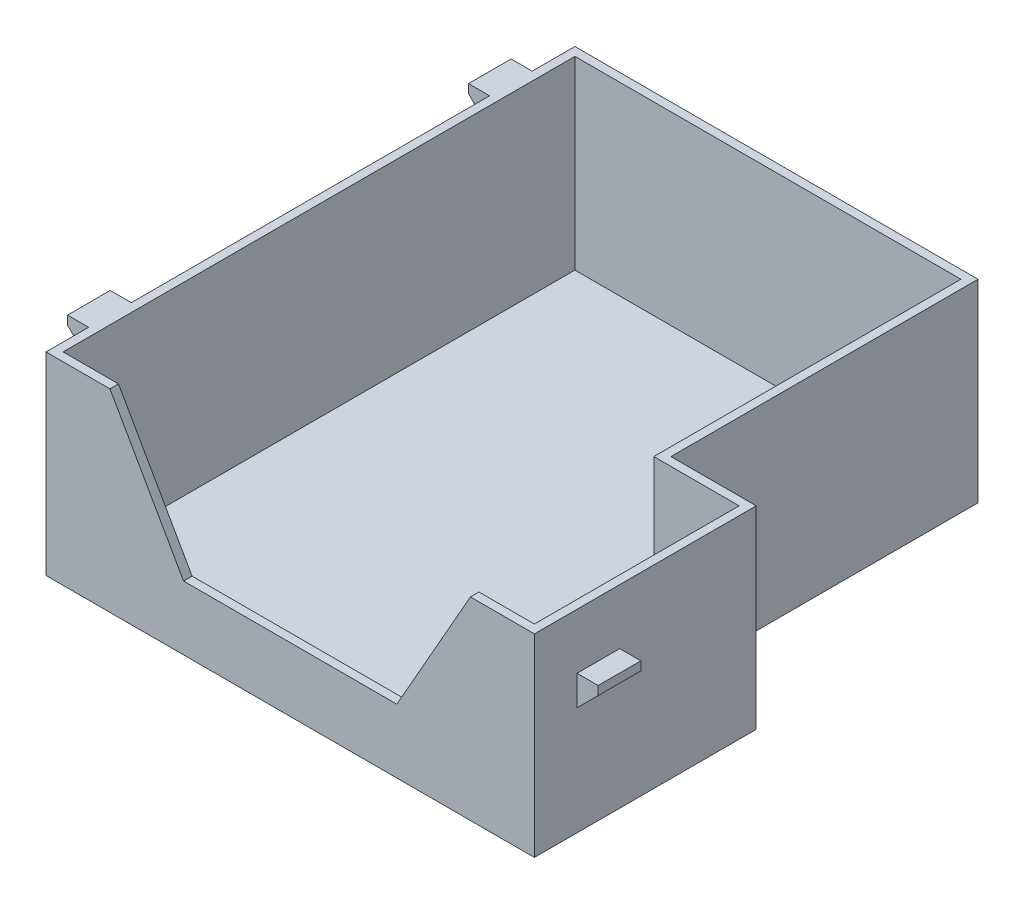
ISO-10303-21;
HEADER;
FILE_DESCRIPTION(('STEP AP214'),'2;1');
FILE_NAME('part.step','',(''),(''),'','','');
FILE_SCHEMA(('AUTOMOTIVE_DESIGN { 1 0 10303 214 1 1 1 1 }'));
ENDSEC;
DATA;
#1=APPLICATION_CONTEXT('core data for automotive mechanical design processes');
#2=APPLICATION_PROTOCOL_DEFINITION('international standard','automotive_design',2000,#1);
#3=PRODUCT_CONTEXT('',#1,'mechanical');
#4=PRODUCT('Part','Part','',(#3));
#5=PRODUCT_RELATED_PRODUCT_CATEGORY('part','',(#4));
#6=PRODUCT_DEFINITION_FORMATION('','',#4);
#7=PRODUCT_DEFINITION_CONTEXT('part definition',#1,'design');
#8=PRODUCT_DEFINITION('design','',#6,#7);
#9=PRODUCT_DEFINITION_SHAPE('','',#8);
#10=(LENGTH_UNIT() NAMED_UNIT(*) SI_UNIT(.MILLI.,.METRE.));
#11=(NAMED_UNIT(*) PLANE_ANGLE_UNIT() SI_UNIT($,.RADIAN.));
#12=(NAMED_UNIT(*) SI_UNIT($,.STERADIAN.) SOLID_ANGLE_UNIT());
#13=UNCERTAINTY_MEASURE_WITH_UNIT(LENGTH_MEASURE(1.E-05),#10,'distance_accuracy_value','');
#14=(GEOMETRIC_REPRESENTATION_CONTEXT(3) GLOBAL_UNCERTAINTY_ASSIGNED_CONTEXT((#13)) GLOBAL_UNIT_ASSIGNED_CONTEXT((#10,
#11,#12)) REPRESENTATION_CONTEXT('',''));
#15=CARTESIAN_POINT('',(0.,0.,0.));
#16=DIRECTION('',(0.,0.,1.));
#17=DIRECTION('',(1.,0.,0.));
#18=AXIS2_PLACEMENT_3D('',#15,#16,#17);
#19=CARTESIAN_POINT('',(0.,2.,0.));
#20=DIRECTION('',(0.,-1.,0.));
#21=DIRECTION('',(0.,0.,-1.));
#22=AXIS2_PLACEMENT_3D('',#19,#20,#21);
#23=PLANE('',#22);
#24=DIRECTION('',(0.,0.,1.));
#25=VECTOR('',#24,1.);
#26=CARTESIAN_POINT('',(35.25,2.,0.));
#27=LINE('',#26,#25);
#28=CARTESIAN_POINT('',(35.25,2.,-60.));
#29=VERTEX_POINT('',#28);
#30=CARTESIAN_POINT('',(35.25,2.,12.));
#31=VERTEX_POINT('',#30);
#32=EDGE_CURVE('E313',#29,#31,#27,.T.);
#33=ORIENTED_EDGE('',*,*,#32,.F.);
#34=DIRECTION('',(-1.,0.,0.));
#35=VECTOR('',#34,1.);
#36=CARTESIAN_POINT('',(0.,2.,-60.));
#37=LINE('',#36,#35);
#38=CARTESIAN_POINT('',(-55.25,2.,-60.));
#39=VERTEX_POINT('',#38);
#40=EDGE_CURVE('E245',#29,#39,#37,.T.);
#41=ORIENTED_EDGE('',*,*,#40,.T.);
#42=DIRECTION('',(0.,0.,1.));
#43=VECTOR('',#42,1.);
#44=CARTESIAN_POINT('',(-55.25,2.,0.));
#45=LINE('',#44,#43);
#46=CARTESIAN_POINT('',(-55.25,2.,60.));
#47=VERTEX_POINT('',#46);
#48=EDGE_CURVE('E419',#39,#47,#45,.T.);
#49=ORIENTED_EDGE('',*,*,#48,.T.);
#50=DIRECTION('',(1.,0.,0.));
#51=VECTOR('',#50,1.);
#52=CARTESIAN_POINT('',(0.,2.,60.));
#53=LINE('',#52,#51);
#54=CARTESIAN_POINT('',(55.25,2.,60.));
#55=VERTEX_POINT('',#54);
#56=EDGE_CURVE('E257',#47,#55,#53,.T.);
#57=ORIENTED_EDGE('',*,*,#56,.T.);
#58=DIRECTION('',(0.,0.,-1.));
#59=VECTOR('',#58,1.);
#60=CARTESIAN_POINT('',(55.25,2.,0.));
#61=LINE('',#60,#59);
#62=CARTESIAN_POINT('',(55.25,2.,12.));
#63=VERTEX_POINT('',#62);
#64=EDGE_CURVE('E414',#55,#63,#61,.T.);
#65=ORIENTED_EDGE('',*,*,#64,.T.);
#66=DIRECTION('',(-1.,0.,0.));
#67=VECTOR('',#66,1.);
#68=CARTESIAN_POINT('',(57.25,2.,12.));
#69=LINE('',#68,#67);
#70=EDGE_CURVE('E62',#63,#31,#69,.T.);
#71=ORIENTED_EDGE('',*,*,#70,.T.);
#72=EDGE_LOOP('',(#33,#41,#49,#57,#65,#71));
#73=FACE_BOUND('',#72,.T.);
#74=ADVANCED_FACE('F39',(#73),#23,.F.);
#75=CARTESIAN_POINT('',(0.,0.,-60.));
#76=DIRECTION('',(0.,0.,1.));
#77=DIRECTION('',(1.,0.,0.));
#78=AXIS2_PLACEMENT_3D('',#75,#76,#77);
#79=PLANE('',#78);
#80=ORIENTED_EDGE('',*,*,#40,.F.);
#81=DIRECTION('',(0.,1.,0.));
#82=VECTOR('',#81,1.);
#83=CARTESIAN_POINT('',(35.25,0.,-60.));
#84=LINE('',#83,#82);
#85=CARTESIAN_POINT('',(35.25,45.4,-60.));
#86=VERTEX_POINT('',#85);
#87=EDGE_CURVE('E229',#29,#86,#84,.T.);
#88=ORIENTED_EDGE('',*,*,#87,.T.);
#89=DIRECTION('',(1.,0.,0.));
#90=VECTOR('',#89,1.);
#91=CARTESIAN_POINT('',(37.25,45.4,-60.));
#92=LINE('',#91,#90);
#93=CARTESIAN_POINT('',(-55.25,45.4,-60.));
#94=VERTEX_POINT('',#93);
#95=EDGE_CURVE('E244',#94,#86,#92,.T.);
#96=ORIENTED_EDGE('',*,*,#95,.F.);
#97=DIRECTION('',(0.,1.,0.));
#98=VECTOR('',#97,1.);
#99=CARTESIAN_POINT('',(-55.25,0.,-60.));
#100=LINE('',#99,#98);
#101=EDGE_CURVE('E422',#39,#94,#100,.T.);
#102=ORIENTED_EDGE('',*,*,#101,.F.);
#103=EDGE_LOOP('',(#80,#88,#96,#102));
#104=FACE_BOUND('',#103,.T.);
#105=ADVANCED_FACE('F242',(#104),#79,.T.);
#106=CARTESIAN_POINT('',(37.25,2.,12.));
#107=DIRECTION('',(-1.,0.,0.));
#108=DIRECTION('',(0.,0.,1.));
#109=AXIS2_PLACEMENT_3D('',#106,#107,#108);
#110=PLANE('',#109);
#111=DIRECTION('',(0.,1.,0.));
#112=VECTOR('',#111,1.);
#113=CARTESIAN_POINT('',(37.25,2.,10.));
#114=LINE('',#113,#112);
#115=CARTESIAN_POINT('',(37.25,0.,10.));
#116=VERTEX_POINT('',#115);
#117=CARTESIAN_POINT('',(37.25,45.4,10.));
#118=VERTEX_POINT('',#117);
#119=EDGE_CURVE('E237',#116,#118,#114,.T.);
#120=ORIENTED_EDGE('',*,*,#119,.F.);
#121=DIRECTION('',(0.,0.,-1.));
#122=VECTOR('',#121,1.);
#123=CARTESIAN_POINT('',(37.25,0.,12.));
#124=LINE('',#123,#122);
#125=CARTESIAN_POINT('',(37.25,0.,-62.));
#126=VERTEX_POINT('',#125);
#127=EDGE_CURVE('E274',#116,#126,#124,.T.);
#128=ORIENTED_EDGE('',*,*,#127,.T.);
#129=DIRECTION('',(0.,-1.,0.));
#130=VECTOR('',#129,1.);
#131=CARTESIAN_POINT('',(37.25,2.,-62.));
#132=LINE('',#131,#130);
#133=CARTESIAN_POINT('',(37.25,45.4,-62.));
#134=VERTEX_POINT('',#133);
#135=EDGE_CURVE('E279',#134,#126,#132,.T.);
#136=ORIENTED_EDGE('',*,*,#135,.F.);
#137=DIRECTION('',(0.,0.,-1.));
#138=VECTOR('',#137,1.);
#139=CARTESIAN_POINT('',(37.25,45.4,-60.));
#140=LINE('',#139,#138);
#141=EDGE_CURVE('E54',#118,#134,#140,.T.);
#142=ORIENTED_EDGE('',*,*,#141,.F.);
#143=EDGE_LOOP('',(#120,#128,#136,#142));
#144=FACE_BOUND('',#143,.T.);
#145=ADVANCED_FACE('F483',(#144),#110,.F.);
#146=CARTESIAN_POINT('',(-57.25,2.,62.));
#147=DIRECTION('',(1.,0.,0.));
#148=DIRECTION('',(0.,0.,-1.));
#149=AXIS2_PLACEMENT_3D('',#146,#147,#148);
#150=PLANE('',#149);
#151=DIRECTION('',(0.,-1.,0.));
#152=VECTOR('',#151,1.);
#153=CARTESIAN_POINT('',(-57.25,45.4,-42.));
#154=LINE('',#153,#152);
#155=CARTESIAN_POINT('',(-57.25,45.4,-42.));
#156=VERTEX_POINT('',#155);
#157=CARTESIAN_POINT('',(-57.25,38.4,-42.));
#158=VERTEX_POINT('',#157);
#159=EDGE_CURVE('E319',#156,#158,#154,.T.);
#160=ORIENTED_EDGE('',*,*,#159,.T.);
#161=DIRECTION('',(0.,0.,-1.));
#162=VECTOR('',#161,1.);
#163=CARTESIAN_POINT('',(-57.25,38.4,-42.));
#164=LINE('',#163,#162);
#165=CARTESIAN_POINT('',(-57.25,38.4,-52.));
#166=VERTEX_POINT('',#165);
#167=EDGE_CURVE('E328',#158,#166,#164,.T.);
#168=ORIENTED_EDGE('',*,*,#167,.T.);
#169=DIRECTION('',(0.,-1.,0.));
#170=VECTOR('',#169,1.);
#171=CARTESIAN_POINT('',(-57.25,45.4,-52.));
#172=LINE('',#171,#170);
#173=CARTESIAN_POINT('',(-57.25,45.4,-52.));
#174=VERTEX_POINT('',#173);
#175=EDGE_CURVE('E331',#174,#166,#172,.T.);
#176=ORIENTED_EDGE('',*,*,#175,.F.);
#177=DIRECTION('',(0.,0.,-1.));
#178=VECTOR('',#177,1.);
#179=CARTESIAN_POINT('',(-57.25,45.4,-60.));
#180=LINE('',#179,#178);
#181=CARTESIAN_POINT('',(-57.25,45.4,-62.));
#182=VERTEX_POINT('',#181);
#183=EDGE_CURVE('E251',#174,#182,#180,.T.);
#184=ORIENTED_EDGE('',*,*,#183,.T.);
#185=DIRECTION('',(0.,-1.,0.));
#186=VECTOR('',#185,1.);
#187=CARTESIAN_POINT('',(-57.25,2.,-62.));
#188=LINE('',#187,#186);
#189=CARTESIAN_POINT('',(-57.25,0.,-62.));
#190=VERTEX_POINT('',#189);
#191=EDGE_CURVE('E267',#182,#190,#188,.T.);
#192=ORIENTED_EDGE('',*,*,#191,.T.);
#193=DIRECTION('',(0.,0.,1.));
#194=VECTOR('',#193,1.);
#195=CARTESIAN_POINT('',(-57.25,0.,62.));
#196=LINE('',#195,#194);
#197=CARTESIAN_POINT('',(-57.25,0.,62.));
#198=VERTEX_POINT('',#197);
#199=EDGE_CURVE('E265',#190,#198,#196,.T.);
#200=ORIENTED_EDGE('',*,*,#199,.T.);
#201=DIRECTION('',(0.,-1.,0.));
#202=VECTOR('',#201,1.);
#203=CARTESIAN_POINT('',(-57.25,2.,62.));
#204=LINE('',#203,#202);
#205=CARTESIAN_POINT('',(-57.25,45.4,62.));
#206=VERTEX_POINT('',#205);
#207=EDGE_CURVE('E11',#206,#198,#204,.T.);
#208=ORIENTED_EDGE('',*,*,#207,.F.);
#209=CARTESIAN_POINT('',(-57.25,45.4,52.));
#210=VERTEX_POINT('',#209);
#211=EDGE_CURVE('E256',#206,#210,#180,.T.);
#212=ORIENTED_EDGE('',*,*,#211,.T.);
#213=DIRECTION('',(0.,1.,0.));
#214=VECTOR('',#213,1.);
#215=CARTESIAN_POINT('',(-57.25,45.4,52.));
#216=LINE('',#215,#214);
#217=CARTESIAN_POINT('',(-57.25,38.4,52.));
#218=VERTEX_POINT('',#217);
#219=EDGE_CURVE('E341',#218,#210,#216,.T.);
#220=ORIENTED_EDGE('',*,*,#219,.F.);
#221=DIRECTION('',(0.,0.,1.));
#222=VECTOR('',#221,1.);
#223=CARTESIAN_POINT('',(-57.25,38.4,42.));
#224=LINE('',#223,#222);
#225=CARTESIAN_POINT('',(-57.25,38.4,42.));
#226=VERTEX_POINT('',#225);
#227=EDGE_CURVE('E369',#226,#218,#224,.T.);
#228=ORIENTED_EDGE('',*,*,#227,.F.);
#229=DIRECTION('',(0.,1.,0.));
#230=VECTOR('',#229,1.);
#231=CARTESIAN_POINT('',(-57.25,45.4,42.));
#232=LINE('',#231,#230);
#233=CARTESIAN_POINT('',(-57.25,45.4,42.));
#234=VERTEX_POINT('',#233);
#235=EDGE_CURVE('E345',#226,#234,#232,.T.);
#236=ORIENTED_EDGE('',*,*,#235,.T.);
#237=EDGE_CURVE('E254',#234,#156,#180,.T.);
#238=ORIENTED_EDGE('',*,*,#237,.T.);
#239=EDGE_LOOP('',(#160,#168,#176,#184,#192,#200,#208,#212,#220,#228,#236,#238));
#240=FACE_BOUND('',#239,.T.);
#241=ADVANCED_FACE('F41',(#240),#150,.F.);
#242=CARTESIAN_POINT('',(-57.25,2.,62.));
#243=DIRECTION('',(0.,0.,-1.));
#244=DIRECTION('',(-1.,0.,0.));
#245=AXIS2_PLACEMENT_3D('',#242,#243,#244);
#246=PLANE('',#245);
#247=DIRECTION('',(1.,0.,0.));
#248=VECTOR('',#247,1.);
#249=CARTESIAN_POINT('',(-57.25,0.,62.));
#250=LINE('',#249,#248);
#251=CARTESIAN_POINT('',(57.25,0.,62.));
#252=VERTEX_POINT('',#251);
#253=EDGE_CURVE('E270',#198,#252,#250,.T.);
#254=ORIENTED_EDGE('',*,*,#253,.T.);
#255=DIRECTION('',(0.,-1.,0.));
#256=VECTOR('',#255,1.);
#257=CARTESIAN_POINT('',(57.25,2.,62.));
#258=LINE('',#257,#256);
#259=CARTESIAN_POINT('',(57.25,45.4,62.));
#260=VERTEX_POINT('',#259);
#261=EDGE_CURVE('E47',#260,#252,#258,.T.);
#262=ORIENTED_EDGE('',*,*,#261,.F.);
#263=DIRECTION('',(-1.,0.,0.));
#264=VECTOR('',#263,1.);
#265=CARTESIAN_POINT('',(42.25,45.4,62.));
#266=LINE('',#265,#264);
#267=CARTESIAN_POINT('',(42.25,45.4,62.));
#268=VERTEX_POINT('',#267);
#269=EDGE_CURVE('E424',#260,#268,#266,.T.);
#270=ORIENTED_EDGE('',*,*,#269,.T.);
#271=DIRECTION('',(-0.493517790988658,-0.869735701220592,0.));
#272=VECTOR('',#271,1.);
#273=CARTESIAN_POINT('',(25.,15.,62.));
#274=LINE('',#273,#272);
#275=CARTESIAN_POINT('',(25.,15.,62.));
#276=VERTEX_POINT('',#275);
#277=EDGE_CURVE('E440',#268,#276,#274,.T.);
#278=ORIENTED_EDGE('',*,*,#277,.T.);
#279=DIRECTION('',(-1.,0.,0.));
#280=VECTOR('',#279,1.);
#281=CARTESIAN_POINT('',(-25.,15.,62.));
#282=LINE('',#281,#280);
#283=CARTESIAN_POINT('',(-25.,15.,62.));
#284=VERTEX_POINT('',#283);
#285=EDGE_CURVE('E443',#276,#284,#282,.T.);
#286=ORIENTED_EDGE('',*,*,#285,.T.);
#287=DIRECTION('',(-0.493517790988659,0.869735701220592,0.));
#288=VECTOR('',#287,1.);
#289=CARTESIAN_POINT('',(-42.25,45.4,62.));
#290=LINE('',#289,#288);
#291=CARTESIAN_POINT('',(-42.25,45.4,62.));
#292=VERTEX_POINT('',#291);
#293=EDGE_CURVE('E446',#284,#292,#290,.T.);
#294=ORIENTED_EDGE('',*,*,#293,.T.);
#295=DIRECTION('',(-1.,0.,0.));
#296=VECTOR('',#295,1.);
#297=CARTESIAN_POINT('',(-57.25,45.4,62.));
#298=LINE('',#297,#296);
#299=EDGE_CURVE('E428',#292,#206,#298,.T.);
#300=ORIENTED_EDGE('',*,*,#299,.T.);
#301=ORIENTED_EDGE('',*,*,#207,.T.);
#302=EDGE_LOOP('',(#254,#262,#270,#278,#286,#294,#300,#301));
#303=FACE_BOUND('',#302,.T.);
#304=ADVANCED_FACE('F466',(#303),#246,.F.);
#305=CARTESIAN_POINT('',(57.25,2.,62.));
#306=DIRECTION('',(-1.,0.,0.));
#307=DIRECTION('',(0.,0.,1.));
#308=AXIS2_PLACEMENT_3D('',#305,#306,#307);
#309=PLANE('',#308);
#310=DIRECTION('',(0.,0.,1.));
#311=VECTOR('',#310,1.);
#312=CARTESIAN_POINT('',(57.25,32.4,42.));
#313=LINE('',#312,#311);
#314=CARTESIAN_POINT('',(57.25,32.4,42.));
#315=VERTEX_POINT('',#314);
#316=CARTESIAN_POINT('',(57.25,32.4,52.));
#317=VERTEX_POINT('',#316);
#318=EDGE_CURVE('E398',#315,#317,#313,.T.);
#319=ORIENTED_EDGE('',*,*,#318,.F.);
#320=DIRECTION('',(0.,-1.,0.));
#321=VECTOR('',#320,1.);
#322=CARTESIAN_POINT('',(57.25,32.4,42.));
#323=LINE('',#322,#321);
#324=CARTESIAN_POINT('',(57.25,25.4,42.));
#325=VERTEX_POINT('',#324);
#326=EDGE_CURVE('E375',#315,#325,#323,.T.);
#327=ORIENTED_EDGE('',*,*,#326,.T.);
#328=DIRECTION('',(0.,0.,1.));
#329=VECTOR('',#328,1.);
#330=CARTESIAN_POINT('',(57.25,25.4,42.));
#331=LINE('',#330,#329);
#332=CARTESIAN_POINT('',(57.25,25.4,52.));
#333=VERTEX_POINT('',#332);
#334=EDGE_CURVE('E387',#325,#333,#331,.T.);
#335=ORIENTED_EDGE('',*,*,#334,.T.);
#336=DIRECTION('',(0.,-1.,0.));
#337=VECTOR('',#336,1.);
#338=CARTESIAN_POINT('',(57.25,32.4,52.));
#339=LINE('',#338,#337);
#340=EDGE_CURVE('E371',#317,#333,#339,.T.);
#341=ORIENTED_EDGE('',*,*,#340,.F.);
#342=EDGE_LOOP('',(#319,#327,#335,#341));
#343=FACE_BOUND('',#342,.T.);
#344=DIRECTION('',(0.,0.,-1.));
#345=VECTOR('',#344,1.);
#346=CARTESIAN_POINT('',(57.25,0.,62.));
#347=LINE('',#346,#345);
#348=CARTESIAN_POINT('',(57.25,0.,10.));
#349=VERTEX_POINT('',#348);
#350=EDGE_CURVE('E272',#252,#349,#347,.T.);
#351=ORIENTED_EDGE('',*,*,#350,.T.);
#352=DIRECTION('',(0.,-1.,0.));
#353=VECTOR('',#352,1.);
#354=CARTESIAN_POINT('',(57.25,0.,10.));
#355=LINE('',#354,#353);
#356=CARTESIAN_POINT('',(57.25,45.4,10.));
#357=VERTEX_POINT('',#356);
#358=EDGE_CURVE('E302',#357,#349,#355,.T.);
#359=ORIENTED_EDGE('',*,*,#358,.F.);
#360=DIRECTION('',(0.,0.,1.));
#361=VECTOR('',#360,1.);
#362=CARTESIAN_POINT('',(57.25,45.4,60.));
#363=LINE('',#362,#361);
#364=EDGE_CURVE('E289',#357,#260,#363,.T.);
#365=ORIENTED_EDGE('',*,*,#364,.T.);
#366=ORIENTED_EDGE('',*,*,#261,.T.);
#367=EDGE_LOOP('',(#351,#359,#365,#366));
#368=FACE_BOUND('',#367,.T.);
#369=ADVANCED_FACE('F285',(#343,#368),#309,.F.);
#370=CARTESIAN_POINT('',(-57.25,2.,-62.));
#371=DIRECTION('',(0.,0.,1.));
#372=DIRECTION('',(1.,0.,0.));
#373=AXIS2_PLACEMENT_3D('',#370,#371,#372);
#374=PLANE('',#373);
#375=DIRECTION('',(-1.,0.,0.));
#376=VECTOR('',#375,1.);
#377=CARTESIAN_POINT('',(-57.25,0.,-62.));
#378=LINE('',#377,#376);
#379=EDGE_CURVE('E268',#126,#190,#378,.T.);
#380=ORIENTED_EDGE('',*,*,#379,.T.);
#381=ORIENTED_EDGE('',*,*,#191,.F.);
#382=DIRECTION('',(1.,0.,0.));
#383=VECTOR('',#382,1.);
#384=CARTESIAN_POINT('',(37.25,45.4,-62.));
#385=LINE('',#384,#383);
#386=EDGE_CURVE('E252',#182,#134,#385,.T.);
#387=ORIENTED_EDGE('',*,*,#386,.T.);
#388=ORIENTED_EDGE('',*,*,#135,.T.);
#389=EDGE_LOOP('',(#380,#381,#387,#388));
#390=FACE_BOUND('',#389,.T.);
#391=ADVANCED_FACE('F481',(#390),#374,.F.);
#392=CARTESIAN_POINT('',(0.,0.,0.));
#393=DIRECTION('',(0.,-1.,0.));
#394=DIRECTION('',(0.,0.,-1.));
#395=AXIS2_PLACEMENT_3D('',#392,#393,#394);
#396=PLANE('',#395);
#397=ORIENTED_EDGE('',*,*,#127,.F.);
#398=DIRECTION('',(-1.,0.,0.));
#399=VECTOR('',#398,1.);
#400=CARTESIAN_POINT('',(57.25,0.,10.));
#401=LINE('',#400,#399);
#402=EDGE_CURVE('E298',#349,#116,#401,.T.);
#403=ORIENTED_EDGE('',*,*,#402,.F.);
#404=ORIENTED_EDGE('',*,*,#350,.F.);
#405=ORIENTED_EDGE('',*,*,#253,.F.);
#406=ORIENTED_EDGE('',*,*,#199,.F.);
#407=ORIENTED_EDGE('',*,*,#379,.F.);
#408=EDGE_LOOP('',(#397,#403,#404,#405,#406,#407));
#409=FACE_BOUND('',#408,.T.);
#410=ADVANCED_FACE('F295',(#409),#396,.T.);
#411=CARTESIAN_POINT('',(37.25,45.4,-60.));
#412=DIRECTION('',(0.,1.,0.));
#413=DIRECTION('',(0.,0.,1.));
#414=AXIS2_PLACEMENT_3D('',#411,#412,#413);
#415=PLANE('',#414);
#416=ORIENTED_EDGE('',*,*,#141,.T.);
#417=ORIENTED_EDGE('',*,*,#386,.F.);
#418=ORIENTED_EDGE('',*,*,#183,.F.);
#419=DIRECTION('',(1.,0.,0.));
#420=VECTOR('',#419,1.);
#421=CARTESIAN_POINT('',(-62.1997474683058,45.4,-52.));
#422=LINE('',#421,#420);
#423=CARTESIAN_POINT('',(-62.1997474683058,45.4,-52.));
#424=VERTEX_POINT('',#423);
#425=EDGE_CURVE('E315',#424,#174,#422,.T.);
#426=ORIENTED_EDGE('',*,*,#425,.F.);
#427=DIRECTION('',(0.,0.,-1.));
#428=VECTOR('',#427,1.);
#429=CARTESIAN_POINT('',(-62.1997474683058,45.4,-42.));
#430=LINE('',#429,#428);
#431=CARTESIAN_POINT('',(-62.1997474683058,45.4,-42.));
#432=VERTEX_POINT('',#431);
#433=EDGE_CURVE('E339',#432,#424,#430,.T.);
#434=ORIENTED_EDGE('',*,*,#433,.F.);
#435=DIRECTION('',(1.,0.,0.));
#436=VECTOR('',#435,1.);
#437=CARTESIAN_POINT('',(-62.1997474683058,45.4,-42.));
#438=LINE('',#437,#436);
#439=EDGE_CURVE('E316',#432,#156,#438,.T.);
#440=ORIENTED_EDGE('',*,*,#439,.T.);
#441=ORIENTED_EDGE('',*,*,#237,.F.);
#442=DIRECTION('',(-1.,0.,0.));
#443=VECTOR('',#442,1.);
#444=CARTESIAN_POINT('',(-62.1997474683058,45.4,42.));
#445=LINE('',#444,#443);
#446=CARTESIAN_POINT('',(-62.1997474683058,45.4,42.));
#447=VERTEX_POINT('',#446);
#448=EDGE_CURVE('E348',#234,#447,#445,.T.);
#449=ORIENTED_EDGE('',*,*,#448,.T.);
#450=DIRECTION('',(0.,0.,1.));
#451=VECTOR('',#450,1.);
#452=CARTESIAN_POINT('',(-62.1997474683058,45.4,42.));
#453=LINE('',#452,#451);
#454=CARTESIAN_POINT('',(-62.1997474683058,45.4,52.));
#455=VERTEX_POINT('',#454);
#456=EDGE_CURVE('E358',#447,#455,#453,.T.);
#457=ORIENTED_EDGE('',*,*,#456,.T.);
#458=DIRECTION('',(-1.,0.,0.));
#459=VECTOR('',#458,1.);
#460=CARTESIAN_POINT('',(-62.1997474683058,45.4,52.));
#461=LINE('',#460,#459);
#462=EDGE_CURVE('E361',#210,#455,#461,.T.);
#463=ORIENTED_EDGE('',*,*,#462,.F.);
#464=ORIENTED_EDGE('',*,*,#211,.F.);
#465=ORIENTED_EDGE('',*,*,#299,.F.);
#466=DIRECTION('',(0.,0.,1.));
#467=VECTOR('',#466,1.);
#468=CARTESIAN_POINT('',(-42.25,45.4,60.));
#469=LINE('',#468,#467);
#470=CARTESIAN_POINT('',(-42.25,45.4,60.));
#471=VERTEX_POINT('',#470);
#472=EDGE_CURVE('E451',#471,#292,#469,.T.);
#473=ORIENTED_EDGE('',*,*,#472,.F.);
#474=DIRECTION('',(-1.,0.,0.));
#475=VECTOR('',#474,1.);
#476=CARTESIAN_POINT('',(-57.25,45.4,60.));
#477=LINE('',#476,#475);
#478=CARTESIAN_POINT('',(-55.25,45.4,60.));
#479=VERTEX_POINT('',#478);
#480=EDGE_CURVE('E437',#471,#479,#477,.T.);
#481=ORIENTED_EDGE('',*,*,#480,.T.);
#482=DIRECTION('',(0.,0.,-1.));
#483=VECTOR('',#482,1.);
#484=CARTESIAN_POINT('',(-55.25,45.4,-62.));
#485=LINE('',#484,#483);
#486=EDGE_CURVE('E250',#479,#94,#485,.T.);
#487=ORIENTED_EDGE('',*,*,#486,.T.);
#488=ORIENTED_EDGE('',*,*,#95,.T.);
#489=DIRECTION('',(0.,0.,1.));
#490=VECTOR('',#489,1.);
#491=CARTESIAN_POINT('',(35.25,45.4,10.));
#492=LINE('',#491,#490);
#493=CARTESIAN_POINT('',(35.25,45.4,12.));
#494=VERTEX_POINT('',#493);
#495=EDGE_CURVE('E226',#86,#494,#492,.T.);
#496=ORIENTED_EDGE('',*,*,#495,.T.);
#497=DIRECTION('',(1.,0.,0.));
#498=VECTOR('',#497,1.);
#499=CARTESIAN_POINT('',(57.25,45.4,12.));
#500=LINE('',#499,#498);
#501=CARTESIAN_POINT('',(55.25,45.4,12.));
#502=VERTEX_POINT('',#501);
#503=EDGE_CURVE('E306',#494,#502,#500,.T.);
#504=ORIENTED_EDGE('',*,*,#503,.T.);
#505=DIRECTION('',(0.,0.,1.));
#506=VECTOR('',#505,1.);
#507=CARTESIAN_POINT('',(55.25,45.4,62.));
#508=LINE('',#507,#506);
#509=CARTESIAN_POINT('',(55.25,45.4,60.));
#510=VERTEX_POINT('',#509);
#511=EDGE_CURVE('E409',#502,#510,#508,.T.);
#512=ORIENTED_EDGE('',*,*,#511,.T.);
#513=DIRECTION('',(-1.,0.,0.));
#514=VECTOR('',#513,1.);
#515=CARTESIAN_POINT('',(42.25,45.4,60.));
#516=LINE('',#515,#514);
#517=CARTESIAN_POINT('',(42.25,45.4,60.));
#518=VERTEX_POINT('',#517);
#519=EDGE_CURVE('E425',#510,#518,#516,.T.);
#520=ORIENTED_EDGE('',*,*,#519,.T.);
#521=DIRECTION('',(0.,0.,1.));
#522=VECTOR('',#521,1.);
#523=CARTESIAN_POINT('',(42.25,45.4,60.));
#524=LINE('',#523,#522);
#525=EDGE_CURVE('E457',#518,#268,#524,.T.);
#526=ORIENTED_EDGE('',*,*,#525,.T.);
#527=ORIENTED_EDGE('',*,*,#269,.F.);
#528=ORIENTED_EDGE('',*,*,#364,.F.);
#529=DIRECTION('',(1.,0.,0.));
#530=VECTOR('',#529,1.);
#531=CARTESIAN_POINT('',(57.25,45.4,10.));
#532=LINE('',#531,#530);
#533=EDGE_CURVE('E238',#118,#357,#532,.T.);
#534=ORIENTED_EDGE('',*,*,#533,.F.);
#535=EDGE_LOOP('',(#416,#417,#418,#426,#434,#440,#441,#449,#457,#463,#464,#465,#473,#481,#487,
#488,#496,#504,#512,#520,#526,#527,#528,#534));
#536=FACE_BOUND('',#535,.T.);
#537=ADVANCED_FACE('F248',(#536),#415,.T.);
#538=CARTESIAN_POINT('',(0.,0.,60.));
#539=DIRECTION('',(0.,0.,-1.));
#540=DIRECTION('',(-1.,0.,0.));
#541=AXIS2_PLACEMENT_3D('',#538,#539,#540);
#542=PLANE('',#541);
#543=DIRECTION('',(0.,1.,0.));
#544=VECTOR('',#543,1.);
#545=CARTESIAN_POINT('',(55.25,0.,60.));
#546=LINE('',#545,#544);
#547=EDGE_CURVE('E412',#55,#510,#546,.T.);
#548=ORIENTED_EDGE('',*,*,#547,.F.);
#549=ORIENTED_EDGE('',*,*,#56,.F.);
#550=DIRECTION('',(0.,-1.,0.));
#551=VECTOR('',#550,1.);
#552=CARTESIAN_POINT('',(-55.25,0.,60.));
#553=LINE('',#552,#551);
#554=EDGE_CURVE('E417',#479,#47,#553,.T.);
#555=ORIENTED_EDGE('',*,*,#554,.F.);
#556=ORIENTED_EDGE('',*,*,#480,.F.);
#557=DIRECTION('',(-0.493517790988659,0.869735701220592,0.));
#558=VECTOR('',#557,1.);
#559=CARTESIAN_POINT('',(-42.25,45.4,60.));
#560=LINE('',#559,#558);
#561=CARTESIAN_POINT('',(-25.,15.,60.));
#562=VERTEX_POINT('',#561);
#563=EDGE_CURVE('E434',#562,#471,#560,.T.);
#564=ORIENTED_EDGE('',*,*,#563,.F.);
#565=DIRECTION('',(-1.,0.,0.));
#566=VECTOR('',#565,1.);
#567=CARTESIAN_POINT('',(-25.,15.,60.));
#568=LINE('',#567,#566);
#569=CARTESIAN_POINT('',(25.,15.,60.));
#570=VERTEX_POINT('',#569);
#571=EDGE_CURVE('E431',#570,#562,#568,.T.);
#572=ORIENTED_EDGE('',*,*,#571,.F.);
#573=DIRECTION('',(-0.493517790988658,-0.869735701220592,0.));
#574=VECTOR('',#573,1.);
#575=CARTESIAN_POINT('',(25.,15.,60.));
#576=LINE('',#575,#574);
#577=EDGE_CURVE('E427',#518,#570,#576,.T.);
#578=ORIENTED_EDGE('',*,*,#577,.F.);
#579=ORIENTED_EDGE('',*,*,#519,.F.);
#580=EDGE_LOOP('',(#548,#549,#555,#556,#564,#572,#578,#579));
#581=FACE_BOUND('',#580,.T.);
#582=ADVANCED_FACE('F693',(#581),#542,.T.);
#583=CARTESIAN_POINT('',(-42.25,45.4,60.));
#584=DIRECTION('',(0.869735701220592,0.493517790988659,0.));
#585=DIRECTION('',(-0.493517790988659,0.869735701220592,0.));
#586=AXIS2_PLACEMENT_3D('',#583,#584,#585);
#587=PLANE('',#586);
#588=ORIENTED_EDGE('',*,*,#293,.F.);
#589=DIRECTION('',(0.,0.,1.));
#590=VECTOR('',#589,1.);
#591=CARTESIAN_POINT('',(-25.,15.,60.));
#592=LINE('',#591,#590);
#593=EDGE_CURVE('E453',#562,#284,#592,.T.);
#594=ORIENTED_EDGE('',*,*,#593,.F.);
#595=ORIENTED_EDGE('',*,*,#563,.T.);
#596=ORIENTED_EDGE('',*,*,#472,.T.);
#597=EDGE_LOOP('',(#588,#594,#595,#596));
#598=FACE_BOUND('',#597,.T.);
#599=ADVANCED_FACE('F473',(#598),#587,.T.);
#600=CARTESIAN_POINT('',(-25.,15.,60.));
#601=DIRECTION('',(0.,1.,0.));
#602=DIRECTION('',(0.,0.,1.));
#603=AXIS2_PLACEMENT_3D('',#600,#601,#602);
#604=PLANE('',#603);
#605=ORIENTED_EDGE('',*,*,#285,.F.);
#606=DIRECTION('',(0.,0.,1.));
#607=VECTOR('',#606,1.);
#608=CARTESIAN_POINT('',(25.,15.,60.));
#609=LINE('',#608,#607);
#610=EDGE_CURVE('E455',#570,#276,#609,.T.);
#611=ORIENTED_EDGE('',*,*,#610,.F.);
#612=ORIENTED_EDGE('',*,*,#571,.T.);
#613=ORIENTED_EDGE('',*,*,#593,.T.);
#614=EDGE_LOOP('',(#605,#611,#612,#613));
#615=FACE_BOUND('',#614,.T.);
#616=ADVANCED_FACE('F469',(#615),#604,.T.);
#617=CARTESIAN_POINT('',(25.,15.,60.));
#618=DIRECTION('',(-0.869735701220592,0.493517790988658,0.));
#619=DIRECTION('',(-0.493517790988658,-0.869735701220592,0.));
#620=AXIS2_PLACEMENT_3D('',#617,#618,#619);
#621=PLANE('',#620);
#622=ORIENTED_EDGE('',*,*,#277,.F.);
#623=ORIENTED_EDGE('',*,*,#525,.F.);
#624=ORIENTED_EDGE('',*,*,#577,.T.);
#625=ORIENTED_EDGE('',*,*,#610,.T.);
#626=EDGE_LOOP('',(#622,#623,#624,#625));
#627=FACE_BOUND('',#626,.T.);
#628=ADVANCED_FACE('F464',(#627),#621,.T.);
#629=CARTESIAN_POINT('',(-55.25,0.,0.));
#630=DIRECTION('',(1.,0.,0.));
#631=DIRECTION('',(0.,0.,-1.));
#632=AXIS2_PLACEMENT_3D('',#629,#630,#631);
#633=PLANE('',#632);
#634=ORIENTED_EDGE('',*,*,#48,.F.);
#635=ORIENTED_EDGE('',*,*,#101,.T.);
#636=ORIENTED_EDGE('',*,*,#486,.F.);
#637=ORIENTED_EDGE('',*,*,#554,.T.);
#638=EDGE_LOOP('',(#634,#635,#636,#637));
#639=FACE_BOUND('',#638,.T.);
#640=ADVANCED_FACE('F575',(#639),#633,.T.);
#641=CARTESIAN_POINT('',(55.25,0.,0.));
#642=DIRECTION('',(-1.,0.,0.));
#643=DIRECTION('',(0.,0.,1.));
#644=AXIS2_PLACEMENT_3D('',#641,#642,#643);
#645=PLANE('',#644);
#646=ORIENTED_EDGE('',*,*,#64,.F.);
#647=ORIENTED_EDGE('',*,*,#547,.T.);
#648=ORIENTED_EDGE('',*,*,#511,.F.);
#649=DIRECTION('',(0.,1.,0.));
#650=VECTOR('',#649,1.);
#651=CARTESIAN_POINT('',(55.25,0.,12.));
#652=LINE('',#651,#650);
#653=EDGE_CURVE('E401',#63,#502,#652,.T.);
#654=ORIENTED_EDGE('',*,*,#653,.F.);
#655=EDGE_LOOP('',(#646,#647,#648,#654));
#656=FACE_BOUND('',#655,.T.);
#657=ADVANCED_FACE('F569',(#656),#645,.T.);
#658=CARTESIAN_POINT('',(62.1997474683058,32.4,42.));
#659=DIRECTION('',(0.,1.,0.));
#660=DIRECTION('',(0.,0.,1.));
#661=AXIS2_PLACEMENT_3D('',#658,#659,#660);
#662=PLANE('',#661);
#663=DIRECTION('',(-1.,0.,0.));
#664=VECTOR('',#663,1.);
#665=CARTESIAN_POINT('',(62.1997474683058,32.4,52.));
#666=LINE('',#665,#664);
#667=CARTESIAN_POINT('',(62.1997474683058,32.4,52.));
#668=VERTEX_POINT('',#667);
#669=EDGE_CURVE('E378',#668,#317,#666,.T.);
#670=ORIENTED_EDGE('',*,*,#669,.F.);
#671=DIRECTION('',(0.,0.,1.));
#672=VECTOR('',#671,1.);
#673=CARTESIAN_POINT('',(62.1997474683058,32.4,42.));
#674=LINE('',#673,#672);
#675=CARTESIAN_POINT('',(62.1997474683058,32.4,42.));
#676=VERTEX_POINT('',#675);
#677=EDGE_CURVE('E402',#676,#668,#674,.T.);
#678=ORIENTED_EDGE('',*,*,#677,.F.);
#679=DIRECTION('',(-1.,0.,0.));
#680=VECTOR('',#679,1.);
#681=CARTESIAN_POINT('',(62.1997474683058,32.4,42.));
#682=LINE('',#681,#680);
#683=EDGE_CURVE('E384',#676,#315,#682,.T.);
#684=ORIENTED_EDGE('',*,*,#683,.T.);
#685=ORIENTED_EDGE('',*,*,#318,.T.);
#686=EDGE_LOOP('',(#670,#678,#684,#685));
#687=FACE_BOUND('',#686,.T.);
#688=ADVANCED_FACE('F574',(#687),#662,.T.);
#689=CARTESIAN_POINT('',(62.1997474683058,30.3497474683059,42.));
#690=DIRECTION('',(1.,0.,0.));
#691=DIRECTION('',(0.,0.,-1.));
#692=AXIS2_PLACEMENT_3D('',#689,#690,#691);
#693=PLANE('',#692);
#694=DIRECTION('',(0.,1.,0.));
#695=VECTOR('',#694,1.);
#696=CARTESIAN_POINT('',(62.1997474683058,30.3497474683059,52.));
#697=LINE('',#696,#695);
#698=CARTESIAN_POINT('',(62.1997474683058,30.3497474683059,52.));
#699=VERTEX_POINT('',#698);
#700=EDGE_CURVE('E393',#699,#668,#697,.T.);
#701=ORIENTED_EDGE('',*,*,#700,.F.);
#702=DIRECTION('',(0.,0.,1.));
#703=VECTOR('',#702,1.);
#704=CARTESIAN_POINT('',(62.1997474683058,30.3497474683059,42.));
#705=LINE('',#704,#703);
#706=CARTESIAN_POINT('',(62.1997474683058,30.3497474683059,42.));
#707=VERTEX_POINT('',#706);
#708=EDGE_CURVE('E404',#707,#699,#705,.T.);
#709=ORIENTED_EDGE('',*,*,#708,.F.);
#710=DIRECTION('',(0.,1.,0.));
#711=VECTOR('',#710,1.);
#712=CARTESIAN_POINT('',(62.1997474683058,30.3497474683059,42.));
#713=LINE('',#712,#711);
#714=EDGE_CURVE('E381',#707,#676,#713,.T.);
#715=ORIENTED_EDGE('',*,*,#714,.T.);
#716=ORIENTED_EDGE('',*,*,#677,.T.);
#717=EDGE_LOOP('',(#701,#709,#715,#716));
#718=FACE_BOUND('',#717,.T.);
#719=ADVANCED_FACE('F673',(#718),#693,.T.);
#720=CARTESIAN_POINT('',(57.25,25.4,42.));
#721=DIRECTION('',(0.707106781186552,-0.707106781186544,0.));
#722=DIRECTION('',(0.707106781186544,0.707106781186551,0.));
#723=AXIS2_PLACEMENT_3D('',#720,#721,#722);
#724=PLANE('',#723);
#725=DIRECTION('',(0.707106781186544,0.707106781186552,0.));
#726=VECTOR('',#725,1.);
#727=CARTESIAN_POINT('',(57.25,25.4,52.));
#728=LINE('',#727,#726);
#729=EDGE_CURVE('E390',#333,#699,#728,.T.);
#730=ORIENTED_EDGE('',*,*,#729,.F.);
#731=ORIENTED_EDGE('',*,*,#334,.F.);
#732=DIRECTION('',(0.707106781186544,0.707106781186552,0.));
#733=VECTOR('',#732,1.);
#734=CARTESIAN_POINT('',(57.25,25.4,42.));
#735=LINE('',#734,#733);
#736=EDGE_CURVE('E377',#325,#707,#735,.T.);
#737=ORIENTED_EDGE('',*,*,#736,.T.);
#738=ORIENTED_EDGE('',*,*,#708,.T.);
#739=EDGE_LOOP('',(#730,#731,#737,#738));
#740=FACE_BOUND('',#739,.T.);
#741=ADVANCED_FACE('F665',(#740),#724,.T.);
#742=CARTESIAN_POINT('',(0.,0.,42.));
#743=DIRECTION('',(0.,0.,-1.));
#744=DIRECTION('',(-1.,0.,0.));
#745=AXIS2_PLACEMENT_3D('',#742,#743,#744);
#746=PLANE('',#745);
#747=ORIENTED_EDGE('',*,*,#326,.F.);
#748=ORIENTED_EDGE('',*,*,#683,.F.);
#749=ORIENTED_EDGE('',*,*,#714,.F.);
#750=ORIENTED_EDGE('',*,*,#736,.F.);
#751=EDGE_LOOP('',(#747,#748,#749,#750));
#752=FACE_BOUND('',#751,.T.);
#753=ADVANCED_FACE('F657',(#752),#746,.T.);
#754=CARTESIAN_POINT('',(0.,0.,52.));
#755=DIRECTION('',(0.,0.,-1.));
#756=DIRECTION('',(-1.,0.,0.));
#757=AXIS2_PLACEMENT_3D('',#754,#755,#756);
#758=PLANE('',#757);
#759=ORIENTED_EDGE('',*,*,#340,.T.);
#760=ORIENTED_EDGE('',*,*,#729,.T.);
#761=ORIENTED_EDGE('',*,*,#700,.T.);
#762=ORIENTED_EDGE('',*,*,#669,.T.);
#763=EDGE_LOOP('',(#759,#760,#761,#762));
#764=FACE_BOUND('',#763,.T.);
#765=ADVANCED_FACE('F649',(#764),#758,.F.);
#766=CARTESIAN_POINT('',(-57.25,38.4,42.));
#767=DIRECTION('',(-0.707106781186551,-0.707106781186544,0.));
#768=DIRECTION('',(0.707106781186544,-0.707106781186551,0.));
#769=AXIS2_PLACEMENT_3D('',#766,#767,#768);
#770=PLANE('',#769);
#771=DIRECTION('',(0.707106781186544,-0.707106781186551,0.));
#772=VECTOR('',#771,1.);
#773=CARTESIAN_POINT('',(-57.25,38.4,52.));
#774=LINE('',#773,#772);
#775=CARTESIAN_POINT('',(-62.1997474683058,43.3497474683058,52.));
#776=VERTEX_POINT('',#775);
#777=EDGE_CURVE('E349',#776,#218,#774,.T.);
#778=ORIENTED_EDGE('',*,*,#777,.F.);
#779=DIRECTION('',(0.,0.,1.));
#780=VECTOR('',#779,1.);
#781=CARTESIAN_POINT('',(-62.1997474683058,43.3497474683058,42.));
#782=LINE('',#781,#780);
#783=CARTESIAN_POINT('',(-62.1997474683058,43.3497474683058,42.));
#784=VERTEX_POINT('',#783);
#785=EDGE_CURVE('E372',#784,#776,#782,.T.);
#786=ORIENTED_EDGE('',*,*,#785,.F.);
#787=DIRECTION('',(0.707106781186544,-0.707106781186551,0.));
#788=VECTOR('',#787,1.);
#789=CARTESIAN_POINT('',(-57.25,38.4,42.));
#790=LINE('',#789,#788);
#791=EDGE_CURVE('E355',#784,#226,#790,.T.);
#792=ORIENTED_EDGE('',*,*,#791,.T.);
#793=ORIENTED_EDGE('',*,*,#227,.T.);
#794=EDGE_LOOP('',(#778,#786,#792,#793));
#795=FACE_BOUND('',#794,.T.);
#796=ADVANCED_FACE('F641',(#795),#770,.T.);
#797=CARTESIAN_POINT('',(-62.1997474683058,43.3497474683058,42.));
#798=DIRECTION('',(-1.,0.,0.));
#799=DIRECTION('',(0.,-1.,0.));
#800=AXIS2_PLACEMENT_3D('',#797,#798,#799);
#801=PLANE('',#800);
#802=DIRECTION('',(0.,-1.,0.));
#803=VECTOR('',#802,1.);
#804=CARTESIAN_POINT('',(-62.1997474683058,43.3497474683058,52.));
#805=LINE('',#804,#803);
#806=EDGE_CURVE('E364',#455,#776,#805,.T.);
#807=ORIENTED_EDGE('',*,*,#806,.F.);
#808=ORIENTED_EDGE('',*,*,#456,.F.);
#809=DIRECTION('',(0.,-1.,0.));
#810=VECTOR('',#809,1.);
#811=CARTESIAN_POINT('',(-62.1997474683058,43.3497474683058,42.));
#812=LINE('',#811,#810);
#813=EDGE_CURVE('E352',#447,#784,#812,.T.);
#814=ORIENTED_EDGE('',*,*,#813,.T.);
#815=ORIENTED_EDGE('',*,*,#785,.T.);
#816=EDGE_LOOP('',(#807,#808,#814,#815));
#817=FACE_BOUND('',#816,.T.);
#818=ADVANCED_FACE('F634',(#817),#801,.T.);
#819=CARTESIAN_POINT('',(0.,0.,42.));
#820=DIRECTION('',(0.,0.,1.));
#821=DIRECTION('',(1.,0.,0.));
#822=AXIS2_PLACEMENT_3D('',#819,#820,#821);
#823=PLANE('',#822);
#824=ORIENTED_EDGE('',*,*,#235,.F.);
#825=ORIENTED_EDGE('',*,*,#791,.F.);
#826=ORIENTED_EDGE('',*,*,#813,.F.);
#827=ORIENTED_EDGE('',*,*,#448,.F.);
#828=EDGE_LOOP('',(#824,#825,#826,#827));
#829=FACE_BOUND('',#828,.T.);
#830=ADVANCED_FACE('F626',(#829),#823,.F.);
#831=CARTESIAN_POINT('',(0.,0.,52.));
#832=DIRECTION('',(0.,0.,1.));
#833=DIRECTION('',(1.,0.,0.));
#834=AXIS2_PLACEMENT_3D('',#831,#832,#833);
#835=PLANE('',#834);
#836=ORIENTED_EDGE('',*,*,#219,.T.);
#837=ORIENTED_EDGE('',*,*,#462,.T.);
#838=ORIENTED_EDGE('',*,*,#806,.T.);
#839=ORIENTED_EDGE('',*,*,#777,.T.);
#840=EDGE_LOOP('',(#836,#837,#838,#839));
#841=FACE_BOUND('',#840,.T.);
#842=ADVANCED_FACE('F509',(#841),#835,.T.);
#843=CARTESIAN_POINT('',(-62.1997474683058,43.3497474683058,-42.));
#844=DIRECTION('',(-1.,0.,0.));
#845=DIRECTION('',(0.,-1.,0.));
#846=AXIS2_PLACEMENT_3D('',#843,#844,#845);
#847=PLANE('',#846);
#848=DIRECTION('',(0.,1.,0.));
#849=VECTOR('',#848,1.);
#850=CARTESIAN_POINT('',(-62.1997474683058,43.3497474683058,-52.));
#851=LINE('',#850,#849);
#852=CARTESIAN_POINT('',(-62.1997474683058,43.3497474683058,-52.));
#853=VERTEX_POINT('',#852);
#854=EDGE_CURVE('E320',#853,#424,#851,.T.);
#855=ORIENTED_EDGE('',*,*,#854,.F.);
#856=DIRECTION('',(0.,0.,-1.));
#857=VECTOR('',#856,1.);
#858=CARTESIAN_POINT('',(-62.1997474683058,43.3497474683058,-42.));
#859=LINE('',#858,#857);
#860=CARTESIAN_POINT('',(-62.1997474683058,43.3497474683058,-42.));
#861=VERTEX_POINT('',#860);
#862=EDGE_CURVE('E342',#861,#853,#859,.T.);
#863=ORIENTED_EDGE('',*,*,#862,.F.);
#864=DIRECTION('',(0.,1.,0.));
#865=VECTOR('',#864,1.);
#866=CARTESIAN_POINT('',(-62.1997474683058,43.3497474683058,-42.));
#867=LINE('',#866,#865);
#868=EDGE_CURVE('E325',#861,#432,#867,.T.);
#869=ORIENTED_EDGE('',*,*,#868,.T.);
#870=ORIENTED_EDGE('',*,*,#433,.T.);
#871=EDGE_LOOP('',(#855,#863,#869,#870));
#872=FACE_BOUND('',#871,.T.);
#873=ADVANCED_FACE('F492',(#872),#847,.T.);
#874=CARTESIAN_POINT('',(-57.25,38.4,-42.));
#875=DIRECTION('',(-0.707106781186551,-0.707106781186544,0.));
#876=DIRECTION('',(0.707106781186544,-0.707106781186551,0.));
#877=AXIS2_PLACEMENT_3D('',#874,#875,#876);
#878=PLANE('',#877);
#879=DIRECTION('',(-0.707106781186544,0.707106781186551,0.));
#880=VECTOR('',#879,1.);
#881=CARTESIAN_POINT('',(-57.25,38.4,-52.));
#882=LINE('',#881,#880);
#883=EDGE_CURVE('E334',#166,#853,#882,.T.);
#884=ORIENTED_EDGE('',*,*,#883,.F.);
#885=ORIENTED_EDGE('',*,*,#167,.F.);
#886=DIRECTION('',(-0.707106781186544,0.707106781186551,0.));
#887=VECTOR('',#886,1.);
#888=CARTESIAN_POINT('',(-57.25,38.4,-42.));
#889=LINE('',#888,#887);
#890=EDGE_CURVE('E322',#158,#861,#889,.T.);
#891=ORIENTED_EDGE('',*,*,#890,.T.);
#892=ORIENTED_EDGE('',*,*,#862,.T.);
#893=EDGE_LOOP('',(#884,#885,#891,#892));
#894=FACE_BOUND('',#893,.T.);
#895=ADVANCED_FACE('F501',(#894),#878,.T.);
#896=CARTESIAN_POINT('',(0.,0.,-42.));
#897=DIRECTION('',(0.,0.,-1.));
#898=DIRECTION('',(-1.,0.,0.));
#899=AXIS2_PLACEMENT_3D('',#896,#897,#898);
#900=PLANE('',#899);
#901=ORIENTED_EDGE('',*,*,#439,.F.);
#902=ORIENTED_EDGE('',*,*,#868,.F.);
#903=ORIENTED_EDGE('',*,*,#890,.F.);
#904=ORIENTED_EDGE('',*,*,#159,.F.);
#905=EDGE_LOOP('',(#901,#902,#903,#904));
#906=FACE_BOUND('',#905,.T.);
#907=ADVANCED_FACE('F498',(#906),#900,.F.);
#908=CARTESIAN_POINT('',(0.,0.,-52.));
#909=DIRECTION('',(0.,0.,-1.));
#910=DIRECTION('',(-1.,0.,0.));
#911=AXIS2_PLACEMENT_3D('',#908,#909,#910);
#912=PLANE('',#911);
#913=ORIENTED_EDGE('',*,*,#425,.T.);
#914=ORIENTED_EDGE('',*,*,#175,.T.);
#915=ORIENTED_EDGE('',*,*,#883,.T.);
#916=ORIENTED_EDGE('',*,*,#854,.T.);
#917=EDGE_LOOP('',(#913,#914,#915,#916));
#918=FACE_BOUND('',#917,.T.);
#919=ADVANCED_FACE('F489',(#918),#912,.T.);
#920=CARTESIAN_POINT('',(35.25,0.,10.));
#921=DIRECTION('',(1.,0.,0.));
#922=DIRECTION('',(0.,0.,-1.));
#923=AXIS2_PLACEMENT_3D('',#920,#921,#922);
#924=PLANE('',#923);
#925=ORIENTED_EDGE('',*,*,#495,.F.);
#926=ORIENTED_EDGE('',*,*,#87,.F.);
#927=ORIENTED_EDGE('',*,*,#32,.T.);
#928=DIRECTION('',(0.,1.,0.));
#929=VECTOR('',#928,1.);
#930=CARTESIAN_POINT('',(35.25,0.,12.));
#931=LINE('',#930,#929);
#932=EDGE_CURVE('E232',#31,#494,#931,.T.);
#933=ORIENTED_EDGE('',*,*,#932,.T.);
#934=EDGE_LOOP('',(#925,#926,#927,#933));
#935=FACE_BOUND('',#934,.T.);
#936=ADVANCED_FACE('F228',(#935),#924,.F.);
#937=CARTESIAN_POINT('',(0.,0.,10.));
#938=DIRECTION('',(0.,0.,1.));
#939=DIRECTION('',(1.,0.,0.));
#940=AXIS2_PLACEMENT_3D('',#937,#938,#939);
#941=PLANE('',#940);
#942=ORIENTED_EDGE('',*,*,#119,.T.);
#943=ORIENTED_EDGE('',*,*,#533,.T.);
#944=ORIENTED_EDGE('',*,*,#358,.T.);
#945=ORIENTED_EDGE('',*,*,#402,.T.);
#946=EDGE_LOOP('',(#942,#943,#944,#945));
#947=FACE_BOUND('',#946,.T.);
#948=ADVANCED_FACE('F304',(#947),#941,.F.);
#949=CARTESIAN_POINT('',(0.,0.,12.));
#950=DIRECTION('',(0.,0.,1.));
#951=DIRECTION('',(1.,0.,0.));
#952=AXIS2_PLACEMENT_3D('',#949,#950,#951);
#953=PLANE('',#952);
#954=ORIENTED_EDGE('',*,*,#932,.F.);
#955=ORIENTED_EDGE('',*,*,#70,.F.);
#956=ORIENTED_EDGE('',*,*,#653,.T.);
#957=ORIENTED_EDGE('',*,*,#503,.F.);
#958=EDGE_LOOP('',(#954,#955,#956,#957));
#959=FACE_BOUND('',#958,.T.);
#960=ADVANCED_FACE('F557',(#959),#953,.T.);
#961=CLOSED_SHELL('',(#74,#105,#145,#241,#304,#369,#391,#410,#537,#582,#599,#616,#628,#640,#657,
#688,#719,#741,#753,#765,#796,#818,#830,#842,#873,#895,#907,#919,#936,#948,#960));
#962=MANIFOLD_SOLID_BREP('B2',#961);
#963=ADVANCED_BREP_SHAPE_REPRESENTATION('',(#18,#962),#14);
#964=SHAPE_DEFINITION_REPRESENTATION(#9,#963);
ENDSEC;
END-ISO-10303-21;
